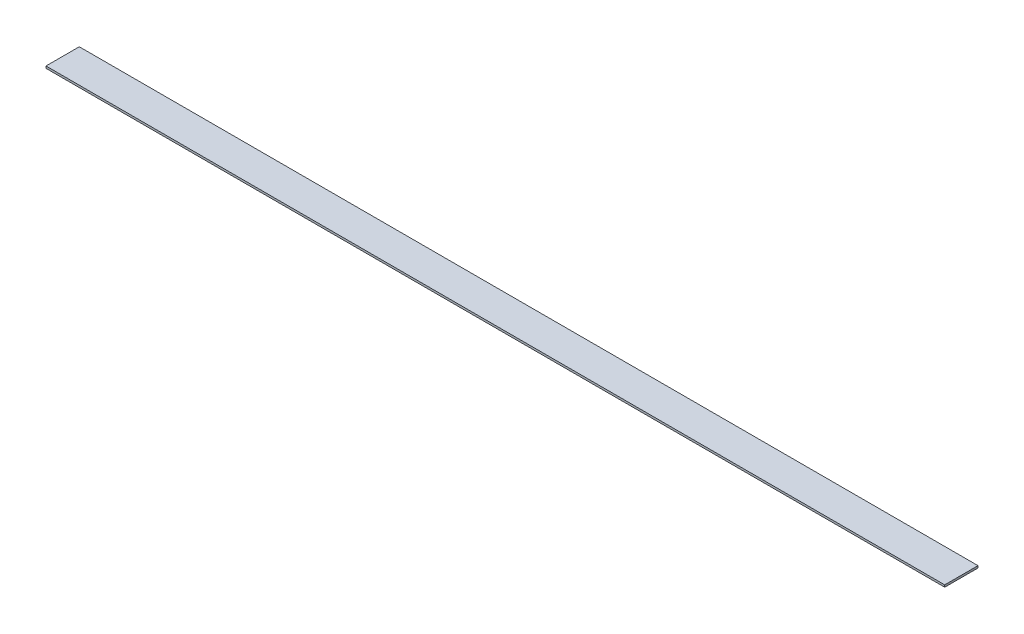
ISO-10303-21;
HEADER;
FILE_DESCRIPTION(('STEP AP214'),'2;1');
FILE_NAME('part.step','',(''),(''),'','','');
FILE_SCHEMA(('AUTOMOTIVE_DESIGN { 1 0 10303 214 1 1 1 1 }'));
ENDSEC;
DATA;
#1=APPLICATION_CONTEXT('core data for automotive mechanical design processes');
#2=APPLICATION_PROTOCOL_DEFINITION('international standard','automotive_design',2000,#1);
#3=PRODUCT_CONTEXT('',#1,'mechanical');
#4=PRODUCT('Part','Part','',(#3));
#5=PRODUCT_RELATED_PRODUCT_CATEGORY('part','',(#4));
#6=PRODUCT_DEFINITION_FORMATION('','',#4);
#7=PRODUCT_DEFINITION_CONTEXT('part definition',#1,'design');
#8=PRODUCT_DEFINITION('design','',#6,#7);
#9=PRODUCT_DEFINITION_SHAPE('','',#8);
#10=(LENGTH_UNIT() NAMED_UNIT(*) SI_UNIT(.MILLI.,.METRE.));
#11=(NAMED_UNIT(*) PLANE_ANGLE_UNIT() SI_UNIT($,.RADIAN.));
#12=(NAMED_UNIT(*) SI_UNIT($,.STERADIAN.) SOLID_ANGLE_UNIT());
#13=UNCERTAINTY_MEASURE_WITH_UNIT(LENGTH_MEASURE(1.E-05),#10,'distance_accuracy_value','');
#14=(GEOMETRIC_REPRESENTATION_CONTEXT(3) GLOBAL_UNCERTAINTY_ASSIGNED_CONTEXT((#13)) GLOBAL_UNIT_ASSIGNED_CONTEXT((#10,
#11,#12)) REPRESENTATION_CONTEXT('',''));
#15=CARTESIAN_POINT('',(0.,0.,0.));
#16=DIRECTION('',(0.,0.,1.));
#17=DIRECTION('',(1.,0.,0.));
#18=AXIS2_PLACEMENT_3D('',#15,#16,#17);
#19=CARTESIAN_POINT('',(342.9,1.5875,-12.7));
#20=DIRECTION('',(-1.,0.,0.));
#21=DIRECTION('',(0.,0.,1.));
#22=AXIS2_PLACEMENT_3D('',#19,#20,#21);
#23=PLANE('',#22);
#24=DIRECTION('',(0.,0.,-1.));
#25=VECTOR('',#24,1.);
#26=CARTESIAN_POINT('',(342.9,0.,-12.7));
#27=LINE('',#26,#25);
#28=CARTESIAN_POINT('',(342.9,0.,12.7));
#29=VERTEX_POINT('',#28);
#30=CARTESIAN_POINT('',(342.9,0.,-12.7));
#31=VERTEX_POINT('',#30);
#32=EDGE_CURVE('E97',#29,#31,#27,.T.);
#33=ORIENTED_EDGE('',*,*,#32,.T.);
#34=DIRECTION('',(0.,-1.,0.));
#35=VECTOR('',#34,1.);
#36=CARTESIAN_POINT('',(342.9,1.5875,-12.7));
#37=LINE('',#36,#35);
#38=CARTESIAN_POINT('',(342.9,1.5875,-12.7));
#39=VERTEX_POINT('',#38);
#40=EDGE_CURVE('E11',#39,#31,#37,.T.);
#41=ORIENTED_EDGE('',*,*,#40,.F.);
#42=DIRECTION('',(0.,0.,-1.));
#43=VECTOR('',#42,1.);
#44=CARTESIAN_POINT('',(342.9,1.5875,-12.7));
#45=LINE('',#44,#43);
#46=CARTESIAN_POINT('',(342.9,1.5875,12.7));
#47=VERTEX_POINT('',#46);
#48=EDGE_CURVE('E85',#47,#39,#45,.T.);
#49=ORIENTED_EDGE('',*,*,#48,.F.);
#50=DIRECTION('',(0.,-1.,0.));
#51=VECTOR('',#50,1.);
#52=CARTESIAN_POINT('',(342.9,1.5875,12.7));
#53=LINE('',#52,#51);
#54=EDGE_CURVE('E93',#47,#29,#53,.T.);
#55=ORIENTED_EDGE('',*,*,#54,.T.);
#56=EDGE_LOOP('',(#33,#41,#49,#55));
#57=FACE_BOUND('',#56,.T.);
#58=ADVANCED_FACE('F34',(#57),#23,.F.);
#59=CARTESIAN_POINT('',(-342.9,1.5875,-12.7));
#60=DIRECTION('',(0.,0.,1.));
#61=DIRECTION('',(1.,0.,0.));
#62=AXIS2_PLACEMENT_3D('',#59,#60,#61);
#63=PLANE('',#62);
#64=DIRECTION('',(-1.,0.,0.));
#65=VECTOR('',#64,1.);
#66=CARTESIAN_POINT('',(-342.9,0.,-12.7));
#67=LINE('',#66,#65);
#68=CARTESIAN_POINT('',(-342.9,0.,-12.7));
#69=VERTEX_POINT('',#68);
#70=EDGE_CURVE('E89',#31,#69,#67,.T.);
#71=ORIENTED_EDGE('',*,*,#70,.T.);
#72=DIRECTION('',(0.,-1.,0.));
#73=VECTOR('',#72,1.);
#74=CARTESIAN_POINT('',(-342.9,1.5875,-12.7));
#75=LINE('',#74,#73);
#76=CARTESIAN_POINT('',(-342.9,1.5875,-12.7));
#77=VERTEX_POINT('',#76);
#78=EDGE_CURVE('E42',#77,#69,#75,.T.);
#79=ORIENTED_EDGE('',*,*,#78,.F.);
#80=DIRECTION('',(-1.,0.,0.));
#81=VECTOR('',#80,1.);
#82=CARTESIAN_POINT('',(-342.9,1.5875,-12.7));
#83=LINE('',#82,#81);
#84=EDGE_CURVE('E80',#39,#77,#83,.T.);
#85=ORIENTED_EDGE('',*,*,#84,.F.);
#86=ORIENTED_EDGE('',*,*,#40,.T.);
#87=EDGE_LOOP('',(#71,#79,#85,#86));
#88=FACE_BOUND('',#87,.T.);
#89=ADVANCED_FACE('F88',(#88),#63,.F.);
#90=CARTESIAN_POINT('',(-342.9,1.5875,-12.7));
#91=DIRECTION('',(1.,0.,0.));
#92=DIRECTION('',(0.,0.,-1.));
#93=AXIS2_PLACEMENT_3D('',#90,#91,#92);
#94=PLANE('',#93);
#95=DIRECTION('',(0.,0.,1.));
#96=VECTOR('',#95,1.);
#97=CARTESIAN_POINT('',(-342.9,0.,-12.7));
#98=LINE('',#97,#96);
#99=CARTESIAN_POINT('',(-342.9,0.,12.7));
#100=VERTEX_POINT('',#99);
#101=EDGE_CURVE('E67',#69,#100,#98,.T.);
#102=ORIENTED_EDGE('',*,*,#101,.T.);
#103=DIRECTION('',(0.,-1.,0.));
#104=VECTOR('',#103,1.);
#105=CARTESIAN_POINT('',(-342.9,1.5875,12.7));
#106=LINE('',#105,#104);
#107=CARTESIAN_POINT('',(-342.9,1.5875,12.7));
#108=VERTEX_POINT('',#107);
#109=EDGE_CURVE('E90',#108,#100,#106,.T.);
#110=ORIENTED_EDGE('',*,*,#109,.F.);
#111=DIRECTION('',(0.,0.,1.));
#112=VECTOR('',#111,1.);
#113=CARTESIAN_POINT('',(-342.9,1.5875,-12.7));
#114=LINE('',#113,#112);
#115=EDGE_CURVE('E83',#77,#108,#114,.T.);
#116=ORIENTED_EDGE('',*,*,#115,.F.);
#117=ORIENTED_EDGE('',*,*,#78,.T.);
#118=EDGE_LOOP('',(#102,#110,#116,#117));
#119=FACE_BOUND('',#118,.T.);
#120=ADVANCED_FACE('F91',(#119),#94,.F.);
#121=CARTESIAN_POINT('',(-342.9,1.5875,12.7));
#122=DIRECTION('',(0.,0.,-1.));
#123=DIRECTION('',(-1.,0.,0.));
#124=AXIS2_PLACEMENT_3D('',#121,#122,#123);
#125=PLANE('',#124);
#126=DIRECTION('',(1.,0.,0.));
#127=VECTOR('',#126,1.);
#128=CARTESIAN_POINT('',(-342.9,0.,12.7));
#129=LINE('',#128,#127);
#130=EDGE_CURVE('E73',#100,#29,#129,.T.);
#131=ORIENTED_EDGE('',*,*,#130,.T.);
#132=ORIENTED_EDGE('',*,*,#54,.F.);
#133=DIRECTION('',(1.,0.,0.));
#134=VECTOR('',#133,1.);
#135=CARTESIAN_POINT('',(-342.9,1.5875,12.7));
#136=LINE('',#135,#134);
#137=EDGE_CURVE('E50',#108,#47,#136,.T.);
#138=ORIENTED_EDGE('',*,*,#137,.F.);
#139=ORIENTED_EDGE('',*,*,#109,.T.);
#140=EDGE_LOOP('',(#131,#132,#138,#139));
#141=FACE_BOUND('',#140,.T.);
#142=ADVANCED_FACE('F104',(#141),#125,.F.);
#143=CARTESIAN_POINT('',(0.,1.5875,0.));
#144=DIRECTION('',(0.,1.,0.));
#145=DIRECTION('',(0.,0.,1.));
#146=AXIS2_PLACEMENT_3D('',#143,#144,#145);
#147=PLANE('',#146);
#148=ORIENTED_EDGE('',*,*,#48,.T.);
#149=ORIENTED_EDGE('',*,*,#84,.T.);
#150=ORIENTED_EDGE('',*,*,#115,.T.);
#151=ORIENTED_EDGE('',*,*,#137,.T.);
#152=EDGE_LOOP('',(#148,#149,#150,#151));
#153=FACE_BOUND('',#152,.T.);
#154=ADVANCED_FACE('F81',(#153),#147,.T.);
#155=CARTESIAN_POINT('',(0.,0.,0.));
#156=DIRECTION('',(0.,1.,0.));
#157=DIRECTION('',(0.,0.,1.));
#158=AXIS2_PLACEMENT_3D('',#155,#156,#157);
#159=PLANE('',#158);
#160=ORIENTED_EDGE('',*,*,#32,.F.);
#161=ORIENTED_EDGE('',*,*,#130,.F.);
#162=ORIENTED_EDGE('',*,*,#101,.F.);
#163=ORIENTED_EDGE('',*,*,#70,.F.);
#164=EDGE_LOOP('',(#160,#161,#162,#163));
#165=FACE_BOUND('',#164,.T.);
#166=ADVANCED_FACE('F107',(#165),#159,.F.);
#167=CLOSED_SHELL('',(#58,#89,#120,#142,#154,#166));
#168=MANIFOLD_SOLID_BREP('B2',#167);
#169=ADVANCED_BREP_SHAPE_REPRESENTATION('',(#18,#168),#14);
#170=SHAPE_DEFINITION_REPRESENTATION(#9,#169);
ENDSEC;
END-ISO-10303-21;
